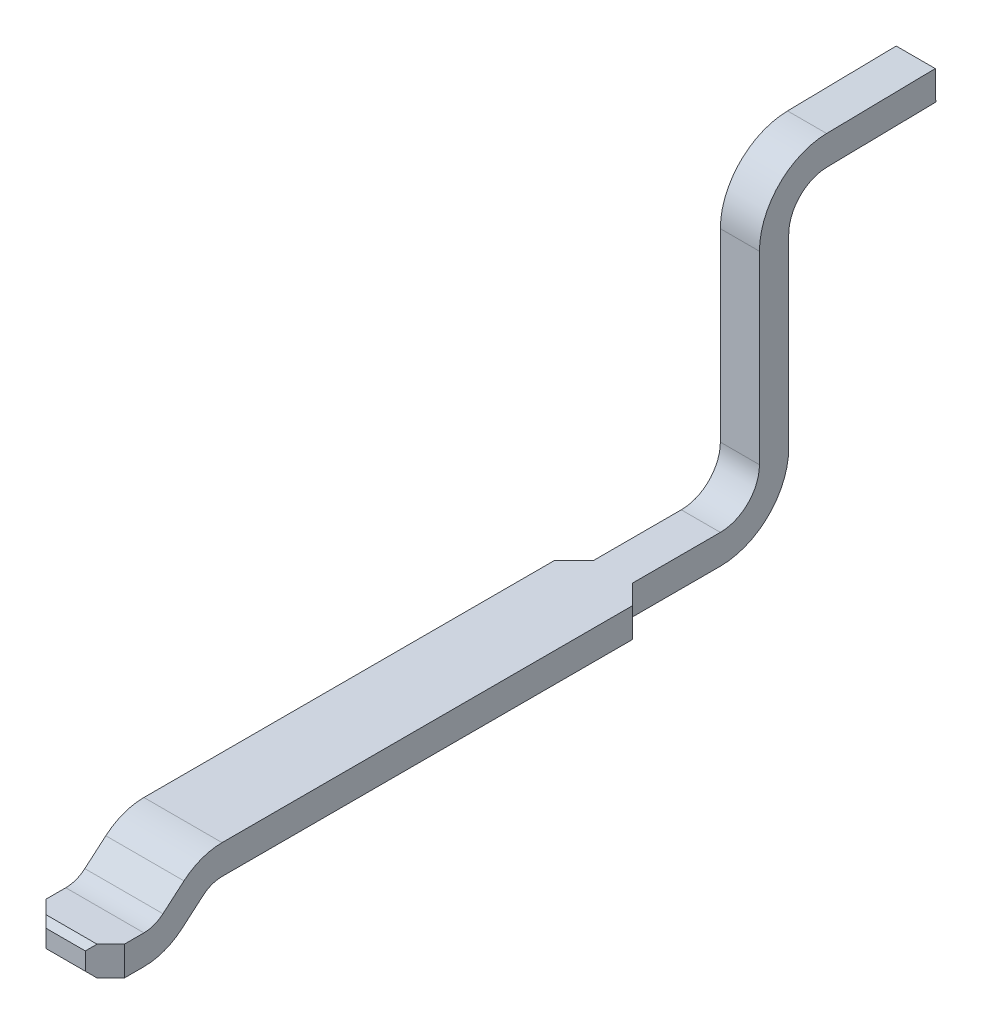
ISO-10303-21;
HEADER;
FILE_DESCRIPTION(('STEP AP214'),'2;1');
FILE_NAME('part.step','',(''),(''),'','','');
FILE_SCHEMA(('AUTOMOTIVE_DESIGN { 1 0 10303 214 1 1 1 1 }'));
ENDSEC;
DATA;
#1=APPLICATION_CONTEXT('core data for automotive mechanical design processes');
#2=APPLICATION_PROTOCOL_DEFINITION('international standard','automotive_design',2000,#1);
#3=PRODUCT_CONTEXT('',#1,'mechanical');
#4=PRODUCT('Part','Part','',(#3));
#5=PRODUCT_RELATED_PRODUCT_CATEGORY('part','',(#4));
#6=PRODUCT_DEFINITION_FORMATION('','',#4);
#7=PRODUCT_DEFINITION_CONTEXT('part definition',#1,'design');
#8=PRODUCT_DEFINITION('design','',#6,#7);
#9=PRODUCT_DEFINITION_SHAPE('','',#8);
#10=(LENGTH_UNIT() NAMED_UNIT(*) SI_UNIT(.MILLI.,.METRE.));
#11=(NAMED_UNIT(*) PLANE_ANGLE_UNIT() SI_UNIT($,.RADIAN.));
#12=(NAMED_UNIT(*) SI_UNIT($,.STERADIAN.) SOLID_ANGLE_UNIT());
#13=UNCERTAINTY_MEASURE_WITH_UNIT(LENGTH_MEASURE(1.E-05),#10,'distance_accuracy_value','');
#14=(GEOMETRIC_REPRESENTATION_CONTEXT(3) GLOBAL_UNCERTAINTY_ASSIGNED_CONTEXT((#13)) GLOBAL_UNIT_ASSIGNED_CONTEXT((#10,
#11,#12)) REPRESENTATION_CONTEXT('',''));
#15=CARTESIAN_POINT('',(0.,0.,0.));
#16=DIRECTION('',(0.,0.,1.));
#17=DIRECTION('',(1.,0.,0.));
#18=AXIS2_PLACEMENT_3D('',#15,#16,#17);
#19=CARTESIAN_POINT('',(-5.49596503503213,8.074228109921,4.324047830079));
#20=DIRECTION('',(0.,0.707106781186548,0.707106781186548));
#21=DIRECTION('',(0.,-0.707106781186548,0.707106781186548));
#22=AXIS2_PLACEMENT_3D('',#19,#20,#21);
#23=PLANE('',#22);
#24=DIRECTION('',(-0.577350269189665,0.577350269189548,-0.577350269189665));
#25=VECTOR('',#24,1.);
#26=CARTESIAN_POINT('',(-5.46026690000014,8.04019892,4.35807702));
#27=LINE('',#26,#25);
#28=CARTESIAN_POINT('',(-5.46026690000013,8.04019892,4.35807702));
#29=VERTEX_POINT('',#28);
#30=CARTESIAN_POINT('',(-5.49026690000014,8.07019892,4.32807702));
#31=VERTEX_POINT('',#30);
#32=EDGE_CURVE('E279',#29,#31,#27,.T.);
#33=ORIENTED_EDGE('',*,*,#32,.F.);
#34=DIRECTION('',(-1.,0.,0.));
#35=VECTOR('',#34,1.);
#36=CARTESIAN_POINT('',(-5.25456876496813,8.04019892,4.35807702));
#37=LINE('',#36,#35);
#38=CARTESIAN_POINT('',(-5.26026690000014,8.04019892,4.35807702));
#39=VERTEX_POINT('',#38);
#40=EDGE_CURVE('E356',#29,#39,#37,.F.);
#41=ORIENTED_EDGE('',*,*,#40,.T.);
#42=DIRECTION('',(-0.577350269189631,-0.577350269189615,0.577350269189631));
#43=VECTOR('',#42,1.);
#44=CARTESIAN_POINT('',(-5.23026690000014,8.07019892,4.32807702));
#45=LINE('',#44,#43);
#46=CARTESIAN_POINT('',(-5.23026690000014,8.07019892,4.32807702));
#47=VERTEX_POINT('',#46);
#48=EDGE_CURVE('E269',#47,#39,#45,.T.);
#49=ORIENTED_EDGE('',*,*,#48,.F.);
#50=DIRECTION('',(1.,0.,0.));
#51=VECTOR('',#50,1.);
#52=CARTESIAN_POINT('',(-5.15226690000013,8.07019892,4.32807702));
#53=LINE('',#52,#51);
#54=EDGE_CURVE('E276',#31,#47,#53,.T.);
#55=ORIENTED_EDGE('',*,*,#54,.F.);
#56=EDGE_LOOP('',(#33,#41,#49,#55));
#57=FACE_BOUND('',#56,.T.);
#58=ADVANCED_FACE('F17',(#57),#23,.T.);
#59=CARTESIAN_POINT('',(-5.25456876496813,7.944500784968,4.35807702));
#60=DIRECTION('',(0.,0.,-1.));
#61=DIRECTION('',(-1.,0.,0.));
#62=AXIS2_PLACEMENT_3D('',#59,#60,#61);
#63=PLANE('',#62);
#64=DIRECTION('',(0.,1.,0.));
#65=VECTOR('',#64,1.);
#66=CARTESIAN_POINT('',(-5.26026690000014,7.914500784968,4.35807702));
#67=LINE('',#66,#65);
#68=CARTESIAN_POINT('',(-5.26026690000014,7.95019892,4.35807702));
#69=VERTEX_POINT('',#68);
#70=EDGE_CURVE('E256',#39,#69,#67,.F.);
#71=ORIENTED_EDGE('',*,*,#70,.F.);
#72=ORIENTED_EDGE('',*,*,#40,.F.);
#73=DIRECTION('',(0.,1.,0.));
#74=VECTOR('',#73,1.);
#75=CARTESIAN_POINT('',(-5.46026690000014,7.914500784968,4.35807702));
#76=LINE('',#75,#74);
#77=CARTESIAN_POINT('',(-5.46026690000013,7.95019892,4.35807702));
#78=VERTEX_POINT('',#77);
#79=EDGE_CURVE('E338',#78,#29,#76,.T.);
#80=ORIENTED_EDGE('',*,*,#79,.F.);
#81=DIRECTION('',(1.,0.,0.));
#82=VECTOR('',#81,1.);
#83=CARTESIAN_POINT('',(-5.22456876496814,7.95019892,4.35807702));
#84=LINE('',#83,#82);
#85=EDGE_CURVE('E331',#69,#78,#84,.F.);
#86=ORIENTED_EDGE('',*,*,#85,.F.);
#87=EDGE_LOOP('',(#71,#72,#80,#86));
#88=FACE_BOUND('',#87,.T.);
#89=ADVANCED_FACE('F775',(#88),#63,.F.);
#90=CARTESIAN_POINT('',(-5.22456876496814,7.916169730079,4.324047830079));
#91=DIRECTION('',(0.,-0.707106781186548,0.707106781186548));
#92=DIRECTION('',(0.,-0.707106781186548,-0.707106781186548));
#93=AXIS2_PLACEMENT_3D('',#90,#91,#92);
#94=PLANE('',#93);
#95=DIRECTION('',(0.57735026918962,-0.577350269189637,-0.57735026918962));
#96=VECTOR('',#95,1.);
#97=CARTESIAN_POINT('',(-5.26026690000014,7.95019892,4.35807702));
#98=LINE('',#97,#96);
#99=CARTESIAN_POINT('',(-5.23026690000014,7.92019892,4.32807702));
#100=VERTEX_POINT('',#99);
#101=EDGE_CURVE('E270',#69,#100,#98,.T.);
#102=ORIENTED_EDGE('',*,*,#101,.F.);
#103=ORIENTED_EDGE('',*,*,#85,.T.);
#104=DIRECTION('',(0.577350269189654,0.57735026918957,0.577350269189654));
#105=VECTOR('',#104,1.);
#106=CARTESIAN_POINT('',(-5.49026690000014,7.92019892,4.32807702));
#107=LINE('',#106,#105);
#108=CARTESIAN_POINT('',(-5.49026690000014,7.92019892,4.32807702));
#109=VERTEX_POINT('',#108);
#110=EDGE_CURVE('E309',#109,#78,#107,.T.);
#111=ORIENTED_EDGE('',*,*,#110,.F.);
#112=DIRECTION('',(1.,0.,0.));
#113=VECTOR('',#112,1.);
#114=CARTESIAN_POINT('',(-5.15226690000013,7.92019892,4.32807702));
#115=LINE('',#114,#113);
#116=EDGE_CURVE('E252',#109,#100,#115,.T.);
#117=ORIENTED_EDGE('',*,*,#116,.T.);
#118=EDGE_LOOP('',(#102,#103,#111,#117));
#119=FACE_BOUND('',#118,.T.);
#120=ADVANCED_FACE('F768',(#119),#94,.T.);
#121=CARTESIAN_POINT('',(-5.25456876496813,8.45127780084181,0.758077020000001));
#122=DIRECTION('',(0.,0.,-1.));
#123=DIRECTION('',(-1.,0.,0.));
#124=AXIS2_PLACEMENT_3D('',#121,#122,#123);
#125=PLANE('',#124);
#126=DIRECTION('',(0.,1.,0.));
#127=VECTOR('',#126,1.);
#128=CARTESIAN_POINT('',(-5.26026690000014,9.610333059471,0.758077020000001));
#129=LINE('',#128,#127);
#130=CARTESIAN_POINT('',(-5.26026690000014,8.47019892,0.758077020000001));
#131=VERTEX_POINT('',#130);
#132=CARTESIAN_POINT('',(-5.26026690000014,9.41625487791,0.758077020000001));
#133=VERTEX_POINT('',#132);
#134=EDGE_CURVE('E416',#131,#133,#129,.T.);
#135=ORIENTED_EDGE('',*,*,#134,.F.);
#136=DIRECTION('',(-1.,0.,0.));
#137=VECTOR('',#136,1.);
#138=CARTESIAN_POINT('',(-5.26026690000014,8.47019892,0.75807702));
#139=LINE('',#138,#137);
#140=CARTESIAN_POINT('',(-5.46026690000013,8.47019892,0.758077020000001));
#141=VERTEX_POINT('',#140);
#142=EDGE_CURVE('E213',#141,#131,#139,.F.);
#143=ORIENTED_EDGE('',*,*,#142,.F.);
#144=DIRECTION('',(0.,1.,0.));
#145=VECTOR('',#144,1.);
#146=CARTESIAN_POINT('',(-5.46026690000013,8.45127780084181,0.758077020000001));
#147=LINE('',#146,#145);
#148=CARTESIAN_POINT('',(-5.46026690000013,9.41625487791,0.758077020000001));
#149=VERTEX_POINT('',#148);
#150=EDGE_CURVE('E412',#149,#141,#147,.F.);
#151=ORIENTED_EDGE('',*,*,#150,.F.);
#152=DIRECTION('',(1.,0.,0.));
#153=VECTOR('',#152,1.);
#154=CARTESIAN_POINT('',(-5.46026690000013,9.41625487791,0.758077020000001));
#155=LINE('',#154,#153);
#156=EDGE_CURVE('E306',#149,#133,#155,.T.);
#157=ORIENTED_EDGE('',*,*,#156,.T.);
#158=EDGE_LOOP('',(#135,#143,#151,#157));
#159=FACE_BOUND('',#158,.T.);
#160=ADVANCED_FACE('F579',(#159),#125,.T.);
#161=CARTESIAN_POINT('',(-5.26026690000014,8.47019892,1.10807702));
#162=DIRECTION('',(-1.,0.,0.));
#163=DIRECTION('',(0.,0.,1.));
#164=AXIS2_PLACEMENT_3D('',#161,#162,#163);
#165=CYLINDRICAL_SURFACE('',#164,0.35);
#166=DIRECTION('',(1.,0.,0.));
#167=VECTOR('',#166,1.);
#168=CARTESIAN_POINT('',(-5.15226690000013,8.12019892,1.10807702));
#169=LINE('',#168,#167);
#170=CARTESIAN_POINT('',(-5.26026690000014,8.12019892,1.10807702));
#171=VERTEX_POINT('',#170);
#172=CARTESIAN_POINT('',(-5.46026690000013,8.12019892,1.10807702));
#173=VERTEX_POINT('',#172);
#174=EDGE_CURVE('E229',#171,#173,#169,.F.);
#175=ORIENTED_EDGE('',*,*,#174,.T.);
#176=CARTESIAN_POINT('',(-5.46026690000013,8.47019892,1.10807702));
#177=DIRECTION('',(-1.,0.,0.));
#178=DIRECTION('',(0.,0.,1.));
#179=AXIS2_PLACEMENT_3D('',#176,#177,#178);
#180=CIRCLE('',#179,0.35);
#181=EDGE_CURVE('E409',#141,#173,#180,.T.);
#182=ORIENTED_EDGE('',*,*,#181,.F.);
#183=ORIENTED_EDGE('',*,*,#142,.T.);
#184=CARTESIAN_POINT('',(-5.26026690000014,8.47019892,1.10807702));
#185=DIRECTION('',(-1.,0.,0.));
#186=DIRECTION('',(0.,0.,1.));
#187=AXIS2_PLACEMENT_3D('',#184,#185,#186);
#188=CIRCLE('',#187,0.35);
#189=EDGE_CURVE('E417',#171,#131,#188,.F.);
#190=ORIENTED_EDGE('',*,*,#189,.F.);
#191=EDGE_LOOP('',(#175,#182,#183,#190));
#192=FACE_BOUND('',#191,.T.);
#193=ADVANCED_FACE('F576',(#192),#165,.T.);
#194=CARTESIAN_POINT('',(-5.25456876496813,8.45127780084181,0.908077020000001));
#195=DIRECTION('',(0.,0.,-1.));
#196=DIRECTION('',(-1.,0.,0.));
#197=AXIS2_PLACEMENT_3D('',#194,#195,#196);
#198=PLANE('',#197);
#199=DIRECTION('',(-1.,0.,0.));
#200=VECTOR('',#199,1.);
#201=CARTESIAN_POINT('',(-5.26026690000014,8.47019892,0.90807702));
#202=LINE('',#201,#200);
#203=CARTESIAN_POINT('',(-5.46026690000013,8.47019892,0.908077020000001));
#204=VERTEX_POINT('',#203);
#205=CARTESIAN_POINT('',(-5.26026690000014,8.47019892,0.908077020000001));
#206=VERTEX_POINT('',#205);
#207=EDGE_CURVE('E218',#204,#206,#202,.F.);
#208=ORIENTED_EDGE('',*,*,#207,.T.);
#209=DIRECTION('',(0.,1.,0.));
#210=VECTOR('',#209,1.);
#211=CARTESIAN_POINT('',(-5.26026690000014,9.610333059471,0.908077020000001));
#212=LINE('',#211,#210);
#213=CARTESIAN_POINT('',(-5.26026690000014,9.41625487791,0.908077020000001));
#214=VERTEX_POINT('',#213);
#215=EDGE_CURVE('E216',#214,#206,#212,.F.);
#216=ORIENTED_EDGE('',*,*,#215,.F.);
#217=DIRECTION('',(1.,0.,0.));
#218=VECTOR('',#217,1.);
#219=CARTESIAN_POINT('',(-5.46026690000013,9.41625487791,0.908077020000001));
#220=LINE('',#219,#218);
#221=CARTESIAN_POINT('',(-5.46026690000013,9.41625487791,0.908077020000001));
#222=VERTEX_POINT('',#221);
#223=EDGE_CURVE('E203',#222,#214,#220,.T.);
#224=ORIENTED_EDGE('',*,*,#223,.F.);
#225=DIRECTION('',(0.,1.,0.));
#226=VECTOR('',#225,1.);
#227=CARTESIAN_POINT('',(-5.46026690000013,8.45127780084181,0.908077020000001));
#228=LINE('',#227,#226);
#229=EDGE_CURVE('E404',#204,#222,#228,.T.);
#230=ORIENTED_EDGE('',*,*,#229,.F.);
#231=EDGE_LOOP('',(#208,#216,#224,#230));
#232=FACE_BOUND('',#231,.T.);
#233=ADVANCED_FACE('F217',(#232),#198,.F.);
#234=CARTESIAN_POINT('',(-5.46026690000013,9.41625487791,0.558077020000001));
#235=DIRECTION('',(1.,0.,0.));
#236=DIRECTION('',(0.,0.,-1.));
#237=AXIS2_PLACEMENT_3D('',#234,#235,#236);
#238=CYLINDRICAL_SURFACE('',#237,0.35);
#239=ORIENTED_EDGE('',*,*,#223,.T.);
#240=CARTESIAN_POINT('',(-5.26026690000014,9.41625487791,0.558077020000001));
#241=DIRECTION('',(1.,0.,0.));
#242=DIRECTION('',(0.,0.,-1.));
#243=AXIS2_PLACEMENT_3D('',#240,#241,#242);
#244=CIRCLE('',#243,0.35);
#245=CARTESIAN_POINT('',(-5.26026690000014,9.76620157121429,0.564185362253241));
#246=VERTEX_POINT('',#245);
#247=EDGE_CURVE('E20',#246,#214,#244,.T.);
#248=ORIENTED_EDGE('',*,*,#247,.F.);
#249=DIRECTION('',(1.,0.,0.));
#250=VECTOR('',#249,1.);
#251=CARTESIAN_POINT('',(-5.46596503503214,9.76620157121458,0.564185362253011));
#252=LINE('',#251,#250);
#253=CARTESIAN_POINT('',(-5.46026690000013,9.76620157121429,0.564185362253241));
#254=VERTEX_POINT('',#253);
#255=EDGE_CURVE('E198',#254,#246,#252,.T.);
#256=ORIENTED_EDGE('',*,*,#255,.F.);
#257=CARTESIAN_POINT('',(-5.46026690000013,9.41625487791,0.558077020000001));
#258=DIRECTION('',(1.,0.,0.));
#259=DIRECTION('',(0.,0.,-1.));
#260=AXIS2_PLACEMENT_3D('',#257,#258,#259);
#261=CIRCLE('',#260,0.35);
#262=EDGE_CURVE('E209',#222,#254,#261,.F.);
#263=ORIENTED_EDGE('',*,*,#262,.F.);
#264=EDGE_LOOP('',(#239,#248,#256,#263));
#265=FACE_BOUND('',#264,.T.);
#266=ADVANCED_FACE('F205',(#265),#238,.T.);
#267=CARTESIAN_POINT('',(-5.46596503503214,9.766007480923,0.575304787611001));
#268=DIRECTION('',(0.,0.999847695156406,0.0174524064364471));
#269=DIRECTION('',(0.,-0.0174524064364471,0.999847695156406));
#270=AXIS2_PLACEMENT_3D('',#267,#268,#269);
#271=PLANE('',#270);
#272=DIRECTION('',(0.,0.0174524064385203,-0.99984769515637));
#273=VECTOR('',#272,1.);
#274=CARTESIAN_POINT('',(-5.46026690000013,9.766201571214,0.564185362253001));
#275=LINE('',#274,#273);
#276=CARTESIAN_POINT('',(-5.46026690000013,9.775906085794,0.00821409435916126));
#277=VERTEX_POINT('',#276);
#278=EDGE_CURVE('E318',#254,#277,#275,.T.);
#279=ORIENTED_EDGE('',*,*,#278,.F.);
#280=ORIENTED_EDGE('',*,*,#255,.T.);
#281=DIRECTION('',(0.,-0.0174524064385203,0.99984769515637));
#282=VECTOR('',#281,1.);
#283=CARTESIAN_POINT('',(-5.26026690000014,9.775906085794,0.00821409435900074));
#284=LINE('',#283,#282);
#285=CARTESIAN_POINT('',(-5.26026690000014,9.775906085794,0.00821409435916126));
#286=VERTEX_POINT('',#285);
#287=EDGE_CURVE('E226',#286,#246,#284,.T.);
#288=ORIENTED_EDGE('',*,*,#287,.F.);
#289=DIRECTION('',(1.,0.,0.));
#290=VECTOR('',#289,1.);
#291=CARTESIAN_POINT('',(-5.25456876496813,9.77590608579399,0.0082140943594823));
#292=LINE('',#291,#290);
#293=EDGE_CURVE('E311',#277,#286,#292,.T.);
#294=ORIENTED_EDGE('',*,*,#293,.F.);
#295=EDGE_LOOP('',(#279,#280,#288,#294));
#296=FACE_BOUND('',#295,.T.);
#297=ADVANCED_FACE('F593',(#296),#271,.T.);
#298=CARTESIAN_POINT('',(-5.25456876496813,9.620231664342,0.00549678722500089));
#299=DIRECTION('',(0.,0.0174524064396861,-0.999847695156349));
#300=DIRECTION('',(0.,0.999847695156349,0.0174524064396861));
#301=AXIS2_PLACEMENT_3D('',#298,#299,#300);
#302=PLANE('',#301);
#303=DIRECTION('',(1.,0.,0.));
#304=VECTOR('',#303,1.);
#305=CARTESIAN_POINT('',(-5.46596503503214,9.62592893152041,0.00559623339400797));
#306=LINE('',#305,#304);
#307=CARTESIAN_POINT('',(-5.26026690000014,9.62592893152018,0.00559623339400417));
#308=VERTEX_POINT('',#307);
#309=CARTESIAN_POINT('',(-5.46026690000013,9.62592893152014,0.00559623339400334));
#310=VERTEX_POINT('',#309);
#311=EDGE_CURVE('E307',#308,#310,#306,.F.);
#312=ORIENTED_EDGE('',*,*,#311,.T.);
#313=DIRECTION('',(0.,-0.999847695156461,-0.0174524064332696));
#314=VECTOR('',#313,1.);
#315=CARTESIAN_POINT('',(-5.46026690000013,9.775906085794,0.00821409435900074));
#316=LINE('',#315,#314);
#317=EDGE_CURVE('E314',#277,#310,#316,.T.);
#318=ORIENTED_EDGE('',*,*,#317,.F.);
#319=ORIENTED_EDGE('',*,*,#293,.T.);
#320=DIRECTION('',(0.,0.999847695156461,0.0174524064332696));
#321=VECTOR('',#320,1.);
#322=CARTESIAN_POINT('',(-5.26026690000014,9.62592893152,0.00559623339400103));
#323=LINE('',#322,#321);
#324=EDGE_CURVE('E328',#308,#286,#323,.T.);
#325=ORIENTED_EDGE('',*,*,#324,.F.);
#326=EDGE_LOOP('',(#312,#318,#319,#325));
#327=FACE_BOUND('',#326,.T.);
#328=ADVANCED_FACE('F592',(#327),#302,.T.);
#329=CARTESIAN_POINT('',(-5.46596503503214,9.616030326649,0.572686926645001));
#330=DIRECTION('',(0.,0.999847695156375,0.0174524064382066));
#331=DIRECTION('',(0.,-0.0174524064382066,0.999847695156375));
#332=AXIS2_PLACEMENT_3D('',#329,#330,#331);
#333=PLANE('',#332);
#334=DIRECTION('',(1.,0.,0.));
#335=VECTOR('',#334,1.);
#336=CARTESIAN_POINT('',(-5.46026690000013,9.61622441694128,0.561567501287006));
#337=LINE('',#336,#335);
#338=CARTESIAN_POINT('',(-5.26026690000014,9.61622441694114,0.561567501287176));
#339=VERTEX_POINT('',#338);
#340=CARTESIAN_POINT('',(-5.46026690000013,9.61622441694114,0.561567501287176));
#341=VERTEX_POINT('',#340);
#342=EDGE_CURVE('E304',#339,#341,#337,.F.);
#343=ORIENTED_EDGE('',*,*,#342,.T.);
#344=DIRECTION('',(0.,-0.0174524064367521,0.999847695156401));
#345=VECTOR('',#344,1.);
#346=CARTESIAN_POINT('',(-5.46026690000013,9.62592893152,0.00559623339400103));
#347=LINE('',#346,#345);
#348=EDGE_CURVE('E317',#310,#341,#347,.T.);
#349=ORIENTED_EDGE('',*,*,#348,.F.);
#350=ORIENTED_EDGE('',*,*,#311,.F.);
#351=DIRECTION('',(0.,0.0174524064367521,-0.999847695156401));
#352=VECTOR('',#351,1.);
#353=CARTESIAN_POINT('',(-5.26026690000014,9.616224416941,0.561567501287001));
#354=LINE('',#353,#352);
#355=EDGE_CURVE('E333',#339,#308,#354,.T.);
#356=ORIENTED_EDGE('',*,*,#355,.F.);
#357=EDGE_LOOP('',(#343,#349,#350,#356));
#358=FACE_BOUND('',#357,.T.);
#359=ADVANCED_FACE('F588',(#358),#333,.F.);
#360=CARTESIAN_POINT('',(-5.46026690000013,9.41625487791,0.558077020000001));
#361=DIRECTION('',(1.,0.,0.));
#362=DIRECTION('',(0.,0.,-1.));
#363=AXIS2_PLACEMENT_3D('',#360,#361,#362);
#364=CYLINDRICAL_SURFACE('',#363,0.2);
#365=ORIENTED_EDGE('',*,*,#156,.F.);
#366=CARTESIAN_POINT('',(-5.46026690000013,9.41625487791,0.558077020000001));
#367=DIRECTION('',(1.,0.,0.));
#368=DIRECTION('',(0.,0.,-1.));
#369=AXIS2_PLACEMENT_3D('',#366,#367,#368);
#370=CIRCLE('',#369,0.2);
#371=EDGE_CURVE('E400',#341,#149,#370,.T.);
#372=ORIENTED_EDGE('',*,*,#371,.F.);
#373=ORIENTED_EDGE('',*,*,#342,.F.);
#374=CARTESIAN_POINT('',(-5.26026690000014,9.41625487791,0.558077020000001));
#375=DIRECTION('',(1.,0.,0.));
#376=DIRECTION('',(0.,0.,-1.));
#377=AXIS2_PLACEMENT_3D('',#374,#375,#376);
#378=CIRCLE('',#377,0.2);
#379=EDGE_CURVE('E414',#133,#339,#378,.F.);
#380=ORIENTED_EDGE('',*,*,#379,.F.);
#381=EDGE_LOOP('',(#365,#372,#373,#380));
#382=FACE_BOUND('',#381,.T.);
#383=ADVANCED_FACE('F584',(#382),#364,.F.);
#384=CARTESIAN_POINT('',(-5.56429608992114,7.914500784968,4.254047830079));
#385=DIRECTION('',(-0.707106781186548,0.,0.707106781186548));
#386=DIRECTION('',(0.707106781186548,0.,0.707106781186548));
#387=AXIS2_PLACEMENT_3D('',#384,#385,#386);
#388=PLANE('',#387);
#389=DIRECTION('',(0.,1.,0.));
#390=VECTOR('',#389,1.);
#391=CARTESIAN_POINT('',(-5.56026690000013,7.914500784968,4.25807702));
#392=LINE('',#391,#390);
#393=CARTESIAN_POINT('',(-5.56026690000013,8.07019892,4.25807702));
#394=VERTEX_POINT('',#393);
#395=CARTESIAN_POINT('',(-5.56026690000013,7.92019892,4.25807702));
#396=VERTEX_POINT('',#395);
#397=EDGE_CURVE('E295',#394,#396,#392,.F.);
#398=ORIENTED_EDGE('',*,*,#397,.T.);
#399=DIRECTION('',(0.707106781186495,0.,0.7071067811866));
#400=VECTOR('',#399,1.);
#401=CARTESIAN_POINT('',(-5.56026690000013,7.92019892,4.25807702));
#402=LINE('',#401,#400);
#403=EDGE_CURVE('E255',#396,#109,#402,.T.);
#404=ORIENTED_EDGE('',*,*,#403,.T.);
#405=ORIENTED_EDGE('',*,*,#110,.T.);
#406=ORIENTED_EDGE('',*,*,#79,.T.);
#407=ORIENTED_EDGE('',*,*,#32,.T.);
#408=DIRECTION('',(0.707106781186495,0.,0.7071067811866));
#409=VECTOR('',#408,1.);
#410=CARTESIAN_POINT('',(-5.56026690000013,8.07019892,4.25807702));
#411=LINE('',#410,#409);
#412=EDGE_CURVE('E275',#394,#31,#411,.T.);
#413=ORIENTED_EDGE('',*,*,#412,.F.);
#414=EDGE_LOOP('',(#398,#404,#405,#406,#407,#413));
#415=FACE_BOUND('',#414,.T.);
#416=ADVANCED_FACE('F712',(#415),#388,.T.);
#417=CARTESIAN_POINT('',(-5.15226690000013,8.102515836027,4.064893542443));
#418=DIRECTION('',(0.,0.759858617954068,0.650088363779058));
#419=DIRECTION('',(0.,-0.650088363779058,0.759858617954068));
#420=AXIS2_PLACEMENT_3D('',#417,#418,#419);
#421=PLANE('',#420);
#422=DIRECTION('',(0.,-0.650088363774947,0.759858617957586));
#423=VECTOR('',#422,1.);
#424=CARTESIAN_POINT('',(-5.56026690000013,8.198156505386,3.953103529133));
#425=LINE('',#424,#423);
#426=CARTESIAN_POINT('',(-5.56026690000013,8.19815650538664,3.95310352913274));
#427=VERTEX_POINT('',#426);
#428=CARTESIAN_POINT('',(-5.56026690000013,8.10622012730668,4.06056376543338));
#429=VERTEX_POINT('',#428);
#430=EDGE_CURVE('E393',#427,#429,#425,.T.);
#431=ORIENTED_EDGE('',*,*,#430,.T.);
#432=DIRECTION('',(-1.,0.,0.));
#433=VECTOR('',#432,1.);
#434=CARTESIAN_POINT('',(-5.16026690000013,8.10622012730701,4.06056376543301));
#435=LINE('',#434,#433);
#436=CARTESIAN_POINT('',(-5.16026690000013,8.10622012730668,4.06056376543338));
#437=VERTEX_POINT('',#436);
#438=EDGE_CURVE('E277',#429,#437,#435,.F.);
#439=ORIENTED_EDGE('',*,*,#438,.T.);
#440=DIRECTION('',(0.,-0.650088363774947,0.759858617957586));
#441=VECTOR('',#440,1.);
#442=CARTESIAN_POINT('',(-5.16026690000013,8.198156505386,3.953103529133));
#443=LINE('',#442,#441);
#444=CARTESIAN_POINT('',(-5.16026690000013,8.19815650538664,3.95310352913274));
#445=VERTEX_POINT('',#444);
#446=EDGE_CURVE('E385',#445,#437,#443,.T.);
#447=ORIENTED_EDGE('',*,*,#446,.F.);
#448=DIRECTION('',(-1.,0.,0.));
#449=VECTOR('',#448,1.);
#450=CARTESIAN_POINT('',(-5.16026690000013,8.19815650538648,3.95310352913341));
#451=LINE('',#450,#449);
#452=EDGE_CURVE('E280',#427,#445,#451,.F.);
#453=ORIENTED_EDGE('',*,*,#452,.F.);
#454=EDGE_LOOP('',(#431,#439,#447,#453));
#455=FACE_BOUND('',#454,.T.);
#456=ADVANCED_FACE('F528',(#455),#421,.T.);
#457=CARTESIAN_POINT('',(-5.16026690000013,8.22019892,4.15807702));
#458=DIRECTION('',(-1.,0.,0.));
#459=DIRECTION('',(0.,0.,1.));
#460=AXIS2_PLACEMENT_3D('',#457,#458,#459);
#461=CYLINDRICAL_SURFACE('',#460,0.15);
#462=CARTESIAN_POINT('',(-5.56026690000013,8.22019892,4.15807702));
#463=DIRECTION('',(-1.,0.,0.));
#464=DIRECTION('',(0.,0.,1.));
#465=AXIS2_PLACEMENT_3D('',#462,#463,#464);
#466=CIRCLE('',#465,0.15);
#467=CARTESIAN_POINT('',(-5.56026690000013,8.07019892,4.15807702));
#468=VERTEX_POINT('',#467);
#469=EDGE_CURVE('E390',#429,#468,#466,.T.);
#470=ORIENTED_EDGE('',*,*,#469,.T.);
#471=DIRECTION('',(1.,0.,0.));
#472=VECTOR('',#471,1.);
#473=CARTESIAN_POINT('',(-5.15226690000013,8.07019892,4.15807702));
#474=LINE('',#473,#472);
#475=CARTESIAN_POINT('',(-5.16026690000013,8.07019892,4.15807702));
#476=VERTEX_POINT('',#475);
#477=EDGE_CURVE('E273',#476,#468,#474,.F.);
#478=ORIENTED_EDGE('',*,*,#477,.F.);
#479=CARTESIAN_POINT('',(-5.16026690000013,8.22019892,4.15807702));
#480=DIRECTION('',(-1.,0.,0.));
#481=DIRECTION('',(0.,0.,1.));
#482=AXIS2_PLACEMENT_3D('',#479,#480,#481);
#483=CIRCLE('',#482,0.15);
#484=EDGE_CURVE('E382',#437,#476,#483,.T.);
#485=ORIENTED_EDGE('',*,*,#484,.F.);
#486=ORIENTED_EDGE('',*,*,#438,.F.);
#487=EDGE_LOOP('',(#470,#478,#485,#486));
#488=FACE_BOUND('',#487,.T.);
#489=ADVANCED_FACE('F533',(#488),#461,.F.);
#490=CARTESIAN_POINT('',(-5.15226690000013,8.07019892,4.333775155032));
#491=DIRECTION('',(0.,1.,0.));
#492=DIRECTION('',(0.,0.,1.));
#493=AXIS2_PLACEMENT_3D('',#490,#491,#492);
#494=PLANE('',#493);
#495=DIRECTION('',(0.,0.,-1.));
#496=VECTOR('',#495,1.);
#497=CARTESIAN_POINT('',(-5.56026690000013,8.07019892,4.163775155032));
#498=LINE('',#497,#496);
#499=EDGE_CURVE('E287',#468,#394,#498,.F.);
#500=ORIENTED_EDGE('',*,*,#499,.T.);
#501=ORIENTED_EDGE('',*,*,#412,.T.);
#502=ORIENTED_EDGE('',*,*,#54,.T.);
#503=DIRECTION('',(0.707106781186548,0.,-0.707106781186548));
#504=VECTOR('',#503,1.);
#505=CARTESIAN_POINT('',(-5.26429608992114,8.07019892,4.362106209921));
#506=LINE('',#505,#504);
#507=CARTESIAN_POINT('',(-5.16026690000013,8.07019892,4.25807702));
#508=VERTEX_POINT('',#507);
#509=EDGE_CURVE('E266',#508,#47,#506,.F.);
#510=ORIENTED_EDGE('',*,*,#509,.F.);
#511=DIRECTION('',(0.,0.,-1.));
#512=VECTOR('',#511,1.);
#513=CARTESIAN_POINT('',(-5.16026690000013,8.07019892,3.80007702));
#514=LINE('',#513,#512);
#515=EDGE_CURVE('E263',#476,#508,#514,.F.);
#516=ORIENTED_EDGE('',*,*,#515,.F.);
#517=ORIENTED_EDGE('',*,*,#477,.T.);
#518=EDGE_LOOP('',(#500,#501,#502,#510,#516,#517));
#519=FACE_BOUND('',#518,.T.);
#520=ADVANCED_FACE('F537',(#519),#494,.T.);
#521=CARTESIAN_POINT('',(-5.26429608992114,7.914500784968,4.362106209921));
#522=DIRECTION('',(0.707106781186548,0.,0.707106781186548));
#523=DIRECTION('',(0.707106781186548,0.,-0.707106781186548));
#524=AXIS2_PLACEMENT_3D('',#521,#522,#523);
#525=PLANE('',#524);
#526=ORIENTED_EDGE('',*,*,#48,.T.);
#527=ORIENTED_EDGE('',*,*,#70,.T.);
#528=ORIENTED_EDGE('',*,*,#101,.T.);
#529=DIRECTION('',(0.707106781186591,0.,-0.707106781186504));
#530=VECTOR('',#529,1.);
#531=CARTESIAN_POINT('',(-5.23026690000014,7.92019892,4.32807702));
#532=LINE('',#531,#530);
#533=CARTESIAN_POINT('',(-5.16026690000013,7.92019892,4.25807702));
#534=VERTEX_POINT('',#533);
#535=EDGE_CURVE('E253',#100,#534,#532,.T.);
#536=ORIENTED_EDGE('',*,*,#535,.T.);
#537=DIRECTION('',(0.,1.,0.));
#538=VECTOR('',#537,1.);
#539=CARTESIAN_POINT('',(-5.16026690000013,8.114500784968,4.25807702));
#540=LINE('',#539,#538);
#541=EDGE_CURVE('E259',#508,#534,#540,.F.);
#542=ORIENTED_EDGE('',*,*,#541,.F.);
#543=ORIENTED_EDGE('',*,*,#509,.T.);
#544=EDGE_LOOP('',(#526,#527,#528,#536,#542,#543));
#545=FACE_BOUND('',#544,.T.);
#546=ADVANCED_FACE('F540',(#545),#525,.T.);
#547=CARTESIAN_POINT('',(-5.15226690000013,7.92019892,4.333775155032));
#548=DIRECTION('',(0.,1.,0.));
#549=DIRECTION('',(0.,0.,1.));
#550=AXIS2_PLACEMENT_3D('',#547,#548,#549);
#551=PLANE('',#550);
#552=ORIENTED_EDGE('',*,*,#403,.F.);
#553=DIRECTION('',(0.,0.,-1.));
#554=VECTOR('',#553,1.);
#555=CARTESIAN_POINT('',(-5.56026690000013,7.92019892,4.163775155032));
#556=LINE('',#555,#554);
#557=CARTESIAN_POINT('',(-5.56026690000013,7.92019892,4.15807702));
#558=VERTEX_POINT('',#557);
#559=EDGE_CURVE('E297',#396,#558,#556,.T.);
#560=ORIENTED_EDGE('',*,*,#559,.T.);
#561=DIRECTION('',(-1.,0.,0.));
#562=VECTOR('',#561,1.);
#563=CARTESIAN_POINT('',(-5.16026690000013,7.92019892,4.15807702));
#564=LINE('',#563,#562);
#565=CARTESIAN_POINT('',(-5.16026690000013,7.92019892,4.15807702));
#566=VERTEX_POINT('',#565);
#567=EDGE_CURVE('E249',#566,#558,#564,.T.);
#568=ORIENTED_EDGE('',*,*,#567,.F.);
#569=DIRECTION('',(0.,0.,-1.));
#570=VECTOR('',#569,1.);
#571=CARTESIAN_POINT('',(-5.16026690000013,7.92019892,3.80007702));
#572=LINE('',#571,#570);
#573=EDGE_CURVE('E262',#534,#566,#572,.T.);
#574=ORIENTED_EDGE('',*,*,#573,.F.);
#575=ORIENTED_EDGE('',*,*,#535,.F.);
#576=ORIENTED_EDGE('',*,*,#116,.F.);
#577=EDGE_LOOP('',(#552,#560,#568,#574,#575,#576));
#578=FACE_BOUND('',#577,.T.);
#579=ADVANCED_FACE('F547',(#578),#551,.F.);
#580=CARTESIAN_POINT('',(-5.16026690000013,8.22019892,4.15807702));
#581=DIRECTION('',(-1.,0.,0.));
#582=DIRECTION('',(0.,0.,1.));
#583=AXIS2_PLACEMENT_3D('',#580,#581,#582);
#584=CYLINDRICAL_SURFACE('',#583,0.3);
#585=CARTESIAN_POINT('',(-5.56026690000013,8.22019892,4.15807702));
#586=DIRECTION('',(-1.,0.,0.));
#587=DIRECTION('',(0.,0.,1.));
#588=AXIS2_PLACEMENT_3D('',#585,#586,#587);
#589=CIRCLE('',#588,0.3);
#590=CARTESIAN_POINT('',(-5.56026690000013,7.99224133461339,3.96305051086728));
#591=VERTEX_POINT('',#590);
#592=EDGE_CURVE('E398',#558,#591,#589,.F.);
#593=ORIENTED_EDGE('',*,*,#592,.T.);
#594=DIRECTION('',(1.,0.,0.));
#595=VECTOR('',#594,1.);
#596=CARTESIAN_POINT('',(-5.15226690000013,7.99224133461357,3.96305051086664));
#597=LINE('',#596,#595);
#598=CARTESIAN_POINT('',(-5.16026690000013,7.99224133461339,3.96305051086728));
#599=VERTEX_POINT('',#598);
#600=EDGE_CURVE('E247',#591,#599,#597,.T.);
#601=ORIENTED_EDGE('',*,*,#600,.T.);
#602=CARTESIAN_POINT('',(-5.16026690000013,8.22019892,4.15807702));
#603=DIRECTION('',(-1.,0.,0.));
#604=DIRECTION('',(0.,0.,1.));
#605=AXIS2_PLACEMENT_3D('',#602,#603,#604);
#606=CIRCLE('',#605,0.3);
#607=EDGE_CURVE('E379',#566,#599,#606,.F.);
#608=ORIENTED_EDGE('',*,*,#607,.F.);
#609=ORIENTED_EDGE('',*,*,#567,.T.);
#610=EDGE_LOOP('',(#593,#601,#608,#609));
#611=FACE_BOUND('',#610,.T.);
#612=ADVANCED_FACE('F551',(#611),#584,.T.);
#613=CARTESIAN_POINT('',(-5.15226690000013,7.988537043334,3.967380287877));
#614=DIRECTION('',(0.,0.759858617954068,0.650088363779058));
#615=DIRECTION('',(0.,-0.650088363779058,0.759858617954068));
#616=AXIS2_PLACEMENT_3D('',#613,#614,#615);
#617=PLANE('',#616);
#618=ORIENTED_EDGE('',*,*,#600,.F.);
#619=DIRECTION('',(0.,0.650088363774937,-0.759858617957595));
#620=VECTOR('',#619,1.);
#621=CARTESIAN_POINT('',(-5.56026690000013,7.992241334614,3.963050510867));
#622=LINE('',#621,#620);
#623=CARTESIAN_POINT('',(-5.56026690000013,8.08417771269332,3.85559027456662));
#624=VERTEX_POINT('',#623);
#625=EDGE_CURVE('E397',#591,#624,#622,.T.);
#626=ORIENTED_EDGE('',*,*,#625,.T.);
#627=DIRECTION('',(-1.,0.,0.));
#628=VECTOR('',#627,1.);
#629=CARTESIAN_POINT('',(-5.16026690000013,8.08417771269299,3.85559027456699));
#630=LINE('',#629,#628);
#631=CARTESIAN_POINT('',(-5.16026690000013,8.08417771269332,3.85559027456662));
#632=VERTEX_POINT('',#631);
#633=EDGE_CURVE('E243',#624,#632,#630,.F.);
#634=ORIENTED_EDGE('',*,*,#633,.T.);
#635=DIRECTION('',(0.,0.650088363774937,-0.759858617957595));
#636=VECTOR('',#635,1.);
#637=CARTESIAN_POINT('',(-5.16026690000013,7.992241334614,3.963050510867));
#638=LINE('',#637,#636);
#639=EDGE_CURVE('E378',#599,#632,#638,.T.);
#640=ORIENTED_EDGE('',*,*,#639,.F.);
#641=EDGE_LOOP('',(#618,#626,#634,#640));
#642=FACE_BOUND('',#641,.T.);
#643=ADVANCED_FACE('F556',(#642),#617,.F.);
#644=CARTESIAN_POINT('',(-5.16026690000013,7.97019892,3.75807702));
#645=DIRECTION('',(-1.,0.,0.));
#646=DIRECTION('',(0.,0.,1.));
#647=AXIS2_PLACEMENT_3D('',#644,#645,#646);
#648=CYLINDRICAL_SURFACE('',#647,0.15);
#649=CARTESIAN_POINT('',(-5.56026690000013,7.97019892,3.75807702));
#650=DIRECTION('',(-1.,0.,0.));
#651=DIRECTION('',(0.,0.,1.));
#652=AXIS2_PLACEMENT_3D('',#649,#650,#651);
#653=CIRCLE('',#652,0.15);
#654=CARTESIAN_POINT('',(-5.56026690000013,8.12019892,3.75807702));
#655=VERTEX_POINT('',#654);
#656=EDGE_CURVE('E394',#624,#655,#653,.T.);
#657=ORIENTED_EDGE('',*,*,#656,.T.);
#658=DIRECTION('',(1.,0.,0.));
#659=VECTOR('',#658,1.);
#660=CARTESIAN_POINT('',(-5.15226690000013,8.12019892,3.75807702));
#661=LINE('',#660,#659);
#662=CARTESIAN_POINT('',(-5.16026690000013,8.12019892,3.75807702));
#663=VERTEX_POINT('',#662);
#664=EDGE_CURVE('E227',#655,#663,#661,.T.);
#665=ORIENTED_EDGE('',*,*,#664,.T.);
#666=CARTESIAN_POINT('',(-5.16026690000013,7.97019892,3.75807702));
#667=DIRECTION('',(-1.,0.,0.));
#668=DIRECTION('',(0.,0.,1.));
#669=AXIS2_PLACEMENT_3D('',#666,#667,#668);
#670=CIRCLE('',#669,0.15);
#671=EDGE_CURVE('E374',#632,#663,#670,.T.);
#672=ORIENTED_EDGE('',*,*,#671,.F.);
#673=ORIENTED_EDGE('',*,*,#633,.F.);
#674=EDGE_LOOP('',(#657,#665,#672,#673));
#675=FACE_BOUND('',#674,.T.);
#676=ADVANCED_FACE('F560',(#675),#648,.F.);
#677=CARTESIAN_POINT('',(-5.15226690000013,8.12019892,3.81107702));
#678=DIRECTION('',(0.,1.,0.));
#679=DIRECTION('',(0.,0.,1.));
#680=AXIS2_PLACEMENT_3D('',#677,#678,#679);
#681=PLANE('',#680);
#682=ORIENTED_EDGE('',*,*,#664,.F.);
#683=DIRECTION('',(0.,0.,-1.));
#684=VECTOR('',#683,1.);
#685=CARTESIAN_POINT('',(-5.56026690000013,8.12019892,4.163775155032));
#686=LINE('',#685,#684);
#687=CARTESIAN_POINT('',(-5.56026690000013,8.12019892,1.65807702));
#688=VERTEX_POINT('',#687);
#689=EDGE_CURVE('E396',#655,#688,#686,.T.);
#690=ORIENTED_EDGE('',*,*,#689,.T.);
#691=DIRECTION('',(-0.707106781186548,0.,0.707106781186548));
#692=VECTOR('',#691,1.);
#693=CARTESIAN_POINT('',(-5.56429608992114,8.12019892,1.662106209921));
#694=LINE('',#693,#692);
#695=CARTESIAN_POINT('',(-5.46026690000013,8.12019892,1.55807702));
#696=VERTEX_POINT('',#695);
#697=EDGE_CURVE('E284',#696,#688,#694,.T.);
#698=ORIENTED_EDGE('',*,*,#697,.F.);
#699=DIRECTION('',(0.,0.,1.));
#700=VECTOR('',#699,1.);
#701=CARTESIAN_POINT('',(-5.46026690000013,8.12019892,0.913775155032));
#702=LINE('',#701,#700);
#703=EDGE_CURVE('E408',#173,#696,#702,.T.);
#704=ORIENTED_EDGE('',*,*,#703,.F.);
#705=ORIENTED_EDGE('',*,*,#174,.F.);
#706=DIRECTION('',(0.,0.,-1.));
#707=VECTOR('',#706,1.);
#708=CARTESIAN_POINT('',(-5.26026690000014,8.12019892,0.572587480477));
#709=LINE('',#708,#707);
#710=CARTESIAN_POINT('',(-5.26026690000014,8.12019892,1.55807702));
#711=VERTEX_POINT('',#710);
#712=EDGE_CURVE('E221',#711,#171,#709,.T.);
#713=ORIENTED_EDGE('',*,*,#712,.F.);
#714=DIRECTION('',(-0.707106781186583,0.,-0.707106781186512));
#715=VECTOR('',#714,1.);
#716=CARTESIAN_POINT('',(-5.16026690000013,8.12019892,1.65807702));
#717=LINE('',#716,#715);
#718=CARTESIAN_POINT('',(-5.16026690000013,8.12019892,1.65807702));
#719=VERTEX_POINT('',#718);
#720=EDGE_CURVE('E241',#719,#711,#717,.T.);
#721=ORIENTED_EDGE('',*,*,#720,.F.);
#722=DIRECTION('',(0.,0.,-1.));
#723=VECTOR('',#722,1.);
#724=CARTESIAN_POINT('',(-5.16026690000013,8.12019892,3.80007702));
#725=LINE('',#724,#723);
#726=EDGE_CURVE('E377',#663,#719,#725,.T.);
#727=ORIENTED_EDGE('',*,*,#726,.F.);
#728=EDGE_LOOP('',(#682,#690,#698,#704,#705,#713,#721,#727));
#729=FACE_BOUND('',#728,.T.);
#730=ADVANCED_FACE('F562',(#729),#681,.F.);
#731=CARTESIAN_POINT('',(-5.26026690000014,9.610333059471,0.572587480477));
#732=DIRECTION('',(1.,0.,0.));
#733=DIRECTION('',(0.,0.,-1.));
#734=AXIS2_PLACEMENT_3D('',#731,#732,#733);
#735=PLANE('',#734);
#736=ORIENTED_EDGE('',*,*,#355,.T.);
#737=ORIENTED_EDGE('',*,*,#324,.T.);
#738=ORIENTED_EDGE('',*,*,#287,.T.);
#739=ORIENTED_EDGE('',*,*,#247,.T.);
#740=ORIENTED_EDGE('',*,*,#215,.T.);
#741=CARTESIAN_POINT('',(-5.26026690000014,8.47019892,1.10807702));
#742=DIRECTION('',(-1.,0.,0.));
#743=DIRECTION('',(0.,0.,1.));
#744=AXIS2_PLACEMENT_3D('',#741,#742,#743);
#745=CIRCLE('',#744,0.2);
#746=CARTESIAN_POINT('',(-5.26026690000014,8.27019892,1.10807702));
#747=VERTEX_POINT('',#746);
#748=EDGE_CURVE('E327',#206,#747,#745,.T.);
#749=ORIENTED_EDGE('',*,*,#748,.T.);
#750=DIRECTION('',(0.,0.,1.));
#751=VECTOR('',#750,1.);
#752=CARTESIAN_POINT('',(-5.26026690000014,8.27019892,3.81107702));
#753=LINE('',#752,#751);
#754=CARTESIAN_POINT('',(-5.26026690000014,8.27019892,1.55807702));
#755=VERTEX_POINT('',#754);
#756=EDGE_CURVE('E238',#755,#747,#753,.F.);
#757=ORIENTED_EDGE('',*,*,#756,.F.);
#758=DIRECTION('',(0.,1.,0.));
#759=VECTOR('',#758,1.);
#760=CARTESIAN_POINT('',(-5.26026690000014,8.275897055032,1.55807702));
#761=LINE('',#760,#759);
#762=EDGE_CURVE('E235',#711,#755,#761,.T.);
#763=ORIENTED_EDGE('',*,*,#762,.F.);
#764=ORIENTED_EDGE('',*,*,#712,.T.);
#765=ORIENTED_EDGE('',*,*,#189,.T.);
#766=ORIENTED_EDGE('',*,*,#134,.T.);
#767=ORIENTED_EDGE('',*,*,#379,.T.);
#768=EDGE_LOOP('',(#736,#737,#738,#739,#740,#749,#757,#763,#764,#765,#766,#767));
#769=FACE_BOUND('',#768,.T.);
#770=ADVANCED_FACE('F224',(#769),#735,.T.);
#771=CARTESIAN_POINT('',(-5.26026690000014,8.47019892,1.10807702));
#772=DIRECTION('',(-1.,0.,0.));
#773=DIRECTION('',(0.,0.,1.));
#774=AXIS2_PLACEMENT_3D('',#771,#772,#773);
#775=CYLINDRICAL_SURFACE('',#774,0.2);
#776=DIRECTION('',(1.,0.,0.));
#777=VECTOR('',#776,1.);
#778=CARTESIAN_POINT('',(-5.15226690000013,8.27019892,1.10807702));
#779=LINE('',#778,#777);
#780=CARTESIAN_POINT('',(-5.46026690000013,8.27019892,1.10807702));
#781=VERTEX_POINT('',#780);
#782=EDGE_CURVE('E435',#747,#781,#779,.F.);
#783=ORIENTED_EDGE('',*,*,#782,.F.);
#784=ORIENTED_EDGE('',*,*,#748,.F.);
#785=ORIENTED_EDGE('',*,*,#207,.F.);
#786=CARTESIAN_POINT('',(-5.46026690000013,8.47019892,1.10807702));
#787=DIRECTION('',(-1.,0.,0.));
#788=DIRECTION('',(0.,0.,1.));
#789=AXIS2_PLACEMENT_3D('',#786,#787,#788);
#790=CIRCLE('',#789,0.2);
#791=EDGE_CURVE('E405',#781,#204,#790,.F.);
#792=ORIENTED_EDGE('',*,*,#791,.F.);
#793=EDGE_LOOP('',(#783,#784,#785,#792));
#794=FACE_BOUND('',#793,.T.);
#795=ADVANCED_FACE('F597',(#794),#775,.F.);
#796=CARTESIAN_POINT('',(-5.46026690000013,8.45127780084181,0.913775155032));
#797=DIRECTION('',(-1.,0.,0.));
#798=DIRECTION('',(0.,0.,1.));
#799=AXIS2_PLACEMENT_3D('',#796,#797,#798);
#800=PLANE('',#799);
#801=ORIENTED_EDGE('',*,*,#348,.T.);
#802=ORIENTED_EDGE('',*,*,#371,.T.);
#803=ORIENTED_EDGE('',*,*,#150,.T.);
#804=ORIENTED_EDGE('',*,*,#181,.T.);
#805=ORIENTED_EDGE('',*,*,#703,.T.);
#806=DIRECTION('',(0.,1.,0.));
#807=VECTOR('',#806,1.);
#808=CARTESIAN_POINT('',(-5.46026690000014,8.275897055032,1.55807701999999));
#809=LINE('',#808,#807);
#810=CARTESIAN_POINT('',(-5.46026690000013,8.27019892,1.55807702));
#811=VERTEX_POINT('',#810);
#812=EDGE_CURVE('E288',#811,#696,#809,.F.);
#813=ORIENTED_EDGE('',*,*,#812,.F.);
#814=DIRECTION('',(0.,0.,1.));
#815=VECTOR('',#814,1.);
#816=CARTESIAN_POINT('',(-5.46026690000013,8.27019892,3.81107702));
#817=LINE('',#816,#815);
#818=EDGE_CURVE('E438',#781,#811,#817,.T.);
#819=ORIENTED_EDGE('',*,*,#818,.F.);
#820=ORIENTED_EDGE('',*,*,#791,.T.);
#821=ORIENTED_EDGE('',*,*,#229,.T.);
#822=ORIENTED_EDGE('',*,*,#262,.T.);
#823=ORIENTED_EDGE('',*,*,#278,.T.);
#824=ORIENTED_EDGE('',*,*,#317,.T.);
#825=EDGE_LOOP('',(#801,#802,#803,#804,#805,#813,#819,#820,#821,#822,#823,#824));
#826=FACE_BOUND('',#825,.T.);
#827=ADVANCED_FACE('F574',(#826),#800,.T.);
#828=CARTESIAN_POINT('',(-5.56429608992114,8.275897055032,1.662106209921));
#829=DIRECTION('',(-0.707106781186548,0.,-0.707106781186548));
#830=DIRECTION('',(-0.707106781186548,0.,0.707106781186548));
#831=AXIS2_PLACEMENT_3D('',#828,#829,#830);
#832=PLANE('',#831);
#833=DIRECTION('',(0.,1.,0.));
#834=VECTOR('',#833,1.);
#835=CARTESIAN_POINT('',(-5.56026690000013,7.914500784968,1.65807702));
#836=LINE('',#835,#834);
#837=CARTESIAN_POINT('',(-5.56026690000013,8.27019892,1.65807702));
#838=VERTEX_POINT('',#837);
#839=EDGE_CURVE('E469',#688,#838,#836,.T.);
#840=ORIENTED_EDGE('',*,*,#839,.T.);
#841=DIRECTION('',(-0.707106781186549,0.,0.707106781186546));
#842=VECTOR('',#841,1.);
#843=CARTESIAN_POINT('',(-5.46026690000013,8.27019892,1.55807702));
#844=LINE('',#843,#842);
#845=EDGE_CURVE('E457',#811,#838,#844,.T.);
#846=ORIENTED_EDGE('',*,*,#845,.F.);
#847=ORIENTED_EDGE('',*,*,#812,.T.);
#848=ORIENTED_EDGE('',*,*,#697,.T.);
#849=EDGE_LOOP('',(#840,#846,#847,#848));
#850=FACE_BOUND('',#849,.T.);
#851=ADVANCED_FACE('F570',(#850),#832,.T.);
#852=CARTESIAN_POINT('',(-5.56026690000013,7.914500784968,4.163775155032));
#853=DIRECTION('',(1.,0.,0.));
#854=DIRECTION('',(0.,0.,-1.));
#855=AXIS2_PLACEMENT_3D('',#852,#853,#854);
#856=PLANE('',#855);
#857=ORIENTED_EDGE('',*,*,#430,.F.);
#858=CARTESIAN_POINT('',(-5.56026690000013,7.97019892,3.75807702));
#859=DIRECTION('',(-1.,0.,0.));
#860=DIRECTION('',(0.,0.,1.));
#861=AXIS2_PLACEMENT_3D('',#858,#859,#860);
#862=CIRCLE('',#861,0.3);
#863=CARTESIAN_POINT('',(-5.56026690000013,8.27019892,3.75807702));
#864=VERTEX_POINT('',#863);
#865=EDGE_CURVE('E283',#864,#427,#862,.F.);
#866=ORIENTED_EDGE('',*,*,#865,.F.);
#867=DIRECTION('',(0.,0.,1.));
#868=VECTOR('',#867,1.);
#869=CARTESIAN_POINT('',(-5.56026690000013,8.27019892,3.81107702));
#870=LINE('',#869,#868);
#871=EDGE_CURVE('E466',#838,#864,#870,.T.);
#872=ORIENTED_EDGE('',*,*,#871,.F.);
#873=ORIENTED_EDGE('',*,*,#839,.F.);
#874=ORIENTED_EDGE('',*,*,#689,.F.);
#875=ORIENTED_EDGE('',*,*,#656,.F.);
#876=ORIENTED_EDGE('',*,*,#625,.F.);
#877=ORIENTED_EDGE('',*,*,#592,.F.);
#878=ORIENTED_EDGE('',*,*,#559,.F.);
#879=ORIENTED_EDGE('',*,*,#397,.F.);
#880=ORIENTED_EDGE('',*,*,#499,.F.);
#881=ORIENTED_EDGE('',*,*,#469,.F.);
#882=EDGE_LOOP('',(#857,#866,#872,#873,#874,#875,#876,#877,#878,#879,#880,#881));
#883=FACE_BOUND('',#882,.T.);
#884=ADVANCED_FACE('F566',(#883),#856,.F.);
#885=CARTESIAN_POINT('',(-5.16026690000013,7.97019892,3.75807702));
#886=DIRECTION('',(-1.,0.,0.));
#887=DIRECTION('',(0.,0.,1.));
#888=AXIS2_PLACEMENT_3D('',#885,#886,#887);
#889=CYLINDRICAL_SURFACE('',#888,0.3);
#890=ORIENTED_EDGE('',*,*,#865,.T.);
#891=ORIENTED_EDGE('',*,*,#452,.T.);
#892=CARTESIAN_POINT('',(-5.16026690000013,7.97019892,3.75807702));
#893=DIRECTION('',(-1.,0.,0.));
#894=DIRECTION('',(0.,0.,1.));
#895=AXIS2_PLACEMENT_3D('',#892,#893,#894);
#896=CIRCLE('',#895,0.3);
#897=CARTESIAN_POINT('',(-5.16026690000013,8.27019892,3.75807702));
#898=VERTEX_POINT('',#897);
#899=EDGE_CURVE('E282',#898,#445,#896,.F.);
#900=ORIENTED_EDGE('',*,*,#899,.F.);
#901=DIRECTION('',(1.,0.,0.));
#902=VECTOR('',#901,1.);
#903=CARTESIAN_POINT('',(-5.15226690000013,8.27019892,3.75807702));
#904=LINE('',#903,#902);
#905=EDGE_CURVE('E487',#864,#898,#904,.T.);
#906=ORIENTED_EDGE('',*,*,#905,.F.);
#907=EDGE_LOOP('',(#890,#891,#900,#906));
#908=FACE_BOUND('',#907,.T.);
#909=ADVANCED_FACE('F525',(#908),#889,.T.);
#910=CARTESIAN_POINT('',(-5.16026690000013,8.114500784968,3.80007702));
#911=DIRECTION('',(1.,0.,0.));
#912=DIRECTION('',(0.,0.,-1.));
#913=AXIS2_PLACEMENT_3D('',#910,#911,#912);
#914=PLANE('',#913);
#915=ORIENTED_EDGE('',*,*,#671,.T.);
#916=ORIENTED_EDGE('',*,*,#726,.T.);
#917=DIRECTION('',(0.,1.,0.));
#918=VECTOR('',#917,1.);
#919=CARTESIAN_POINT('',(-5.16026690000014,8.275897055032,1.65807702));
#920=LINE('',#919,#918);
#921=CARTESIAN_POINT('',(-5.16026690000013,8.27019892,1.65807702));
#922=VERTEX_POINT('',#921);
#923=EDGE_CURVE('E35',#922,#719,#920,.F.);
#924=ORIENTED_EDGE('',*,*,#923,.F.);
#925=DIRECTION('',(0.,0.,1.));
#926=VECTOR('',#925,1.);
#927=CARTESIAN_POINT('',(-5.16026690000013,8.27019892,3.81107702));
#928=LINE('',#927,#926);
#929=EDGE_CURVE('E26',#898,#922,#928,.F.);
#930=ORIENTED_EDGE('',*,*,#929,.F.);
#931=ORIENTED_EDGE('',*,*,#899,.T.);
#932=ORIENTED_EDGE('',*,*,#446,.T.);
#933=ORIENTED_EDGE('',*,*,#484,.T.);
#934=ORIENTED_EDGE('',*,*,#515,.T.);
#935=ORIENTED_EDGE('',*,*,#541,.T.);
#936=ORIENTED_EDGE('',*,*,#573,.T.);
#937=ORIENTED_EDGE('',*,*,#607,.T.);
#938=ORIENTED_EDGE('',*,*,#639,.T.);
#939=EDGE_LOOP('',(#915,#916,#924,#930,#931,#932,#933,#934,#935,#936,#937,#938));
#940=FACE_BOUND('',#939,.T.);
#941=ADVANCED_FACE('F514',(#940),#914,.T.);
#942=CARTESIAN_POINT('',(-5.26429608992114,8.275897055032,1.554047830079));
#943=DIRECTION('',(0.707106781186548,0.,-0.707106781186548));
#944=DIRECTION('',(-0.707106781186548,0.,-0.707106781186548));
#945=AXIS2_PLACEMENT_3D('',#942,#943,#944);
#946=PLANE('',#945);
#947=ORIENTED_EDGE('',*,*,#762,.T.);
#948=DIRECTION('',(-0.707106781186583,0.,-0.707106781186512));
#949=VECTOR('',#948,1.);
#950=CARTESIAN_POINT('',(-5.16026690000013,8.27019892,1.65807702));
#951=LINE('',#950,#949);
#952=EDGE_CURVE('E11',#922,#755,#951,.T.);
#953=ORIENTED_EDGE('',*,*,#952,.F.);
#954=ORIENTED_EDGE('',*,*,#923,.T.);
#955=ORIENTED_EDGE('',*,*,#720,.T.);
#956=EDGE_LOOP('',(#947,#953,#954,#955));
#957=FACE_BOUND('',#956,.T.);
#958=ADVANCED_FACE('F519',(#957),#946,.T.);
#959=CARTESIAN_POINT('',(-5.15226690000013,8.27019892,3.81107702));
#960=DIRECTION('',(0.,1.,0.));
#961=DIRECTION('',(0.,0.,1.));
#962=AXIS2_PLACEMENT_3D('',#959,#960,#961);
#963=PLANE('',#962);
#964=ORIENTED_EDGE('',*,*,#929,.T.);
#965=ORIENTED_EDGE('',*,*,#952,.T.);
#966=ORIENTED_EDGE('',*,*,#756,.T.);
#967=ORIENTED_EDGE('',*,*,#782,.T.);
#968=ORIENTED_EDGE('',*,*,#818,.T.);
#969=ORIENTED_EDGE('',*,*,#845,.T.);
#970=ORIENTED_EDGE('',*,*,#871,.T.);
#971=ORIENTED_EDGE('',*,*,#905,.T.);
#972=EDGE_LOOP('',(#964,#965,#966,#967,#968,#969,#970,#971));
#973=FACE_BOUND('',#972,.T.);
#974=ADVANCED_FACE('F521',(#973),#963,.T.);
#975=CLOSED_SHELL('',(#58,#89,#120,#160,#193,#233,#266,#297,#328,#359,#383,#416,#456,#489,#520,
#546,#579,#612,#643,#676,#730,#770,#795,#827,#851,#884,#909,#941,#958,#974));
#976=MANIFOLD_SOLID_BREP('B1',#975);
#977=ADVANCED_BREP_SHAPE_REPRESENTATION('',(#18,#976),#14);
#978=SHAPE_DEFINITION_REPRESENTATION(#9,#977);
ENDSEC;
END-ISO-10303-21;
